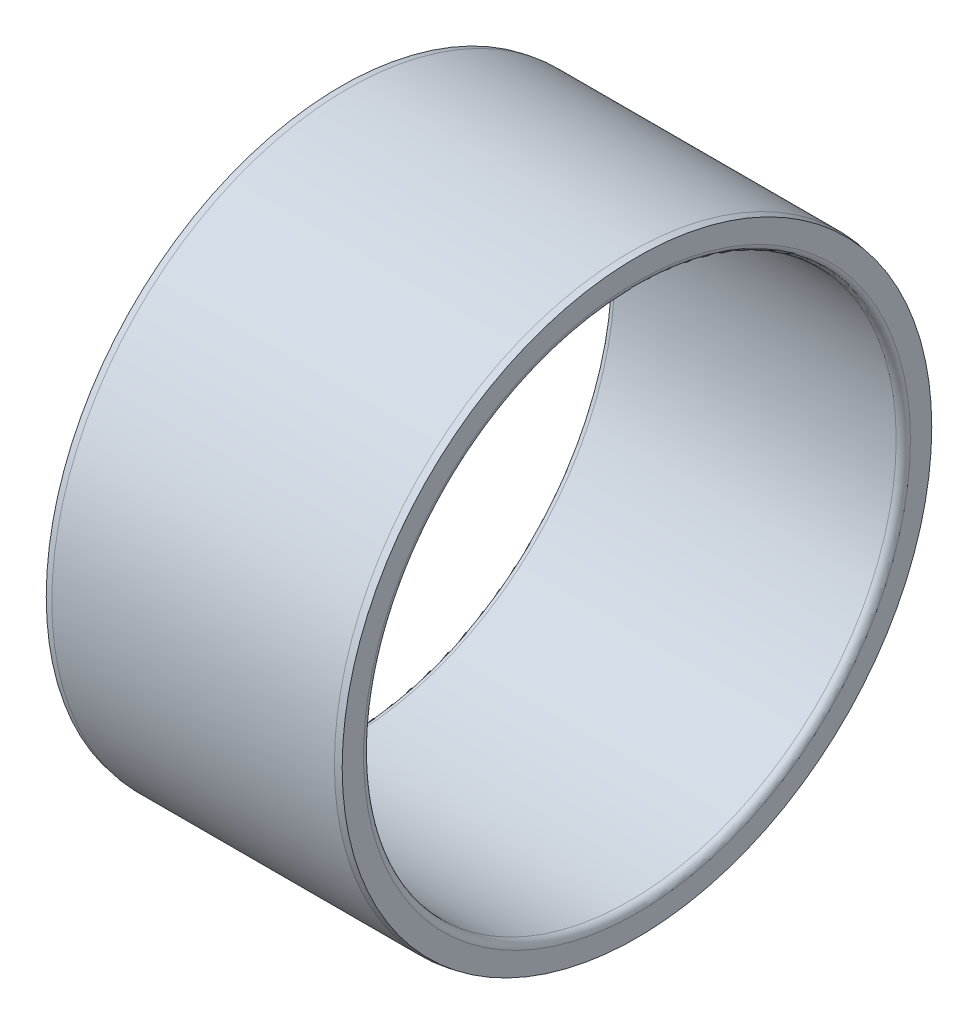
ISO-10303-21;
HEADER;
FILE_DESCRIPTION(('STEP AP214'),'2;1');
FILE_NAME('part.step','',(''),(''),'','','');
FILE_SCHEMA(('AUTOMOTIVE_DESIGN { 1 0 10303 214 1 1 1 1 }'));
ENDSEC;
DATA;
#1=APPLICATION_CONTEXT('core data for automotive mechanical design processes');
#2=APPLICATION_PROTOCOL_DEFINITION('international standard','automotive_design',2000,#1);
#3=PRODUCT_CONTEXT('',#1,'mechanical');
#4=PRODUCT('Part','Part','',(#3));
#5=PRODUCT_RELATED_PRODUCT_CATEGORY('part','',(#4));
#6=PRODUCT_DEFINITION_FORMATION('','',#4);
#7=PRODUCT_DEFINITION_CONTEXT('part definition',#1,'design');
#8=PRODUCT_DEFINITION('design','',#6,#7);
#9=PRODUCT_DEFINITION_SHAPE('','',#8);
#10=(LENGTH_UNIT() NAMED_UNIT(*) SI_UNIT(.MILLI.,.METRE.));
#11=(NAMED_UNIT(*) PLANE_ANGLE_UNIT() SI_UNIT($,.RADIAN.));
#12=(NAMED_UNIT(*) SI_UNIT($,.STERADIAN.) SOLID_ANGLE_UNIT());
#13=UNCERTAINTY_MEASURE_WITH_UNIT(LENGTH_MEASURE(1.E-05),#10,'distance_accuracy_value','');
#14=(GEOMETRIC_REPRESENTATION_CONTEXT(3) GLOBAL_UNCERTAINTY_ASSIGNED_CONTEXT((#13)) GLOBAL_UNIT_ASSIGNED_CONTEXT((#10,
#11,#12)) REPRESENTATION_CONTEXT('',''));
#15=CARTESIAN_POINT('',(0.,0.,0.));
#16=DIRECTION('',(0.,0.,1.));
#17=DIRECTION('',(1.,0.,0.));
#18=AXIS2_PLACEMENT_3D('',#15,#16,#17);
#19=CARTESIAN_POINT('',(0.,24.90437,0.));
#20=DIRECTION('',(-1.,0.,0.));
#21=DIRECTION('',(0.,0.,1.));
#22=AXIS2_PLACEMENT_3D('',#19,#20,#21);
#23=PLANE('',#22);
#24=CARTESIAN_POINT('',(0.,0.,0.));
#25=DIRECTION('',(1.,0.,0.));
#26=DIRECTION('',(0.,0.,-1.));
#27=AXIS2_PLACEMENT_3D('',#24,#25,#26);
#28=CIRCLE('',#27,23.1);
#29=CARTESIAN_POINT('',(0.,0.,-23.1));
#30=VERTEX_POINT('',#29);
#31=EDGE_CURVE('E44',#30,#30,#28,.T.);
#32=ORIENTED_EDGE('',*,*,#31,.T.);
#33=EDGE_LOOP('',(#32));
#34=FACE_BOUND('',#33,.T.);
#35=CARTESIAN_POINT('',(0.,0.,0.));
#36=DIRECTION('',(1.,0.,0.));
#37=DIRECTION('',(0.,0.,-1.));
#38=AXIS2_PLACEMENT_3D('',#35,#36,#37);
#39=CIRCLE('',#38,24.90437);
#40=CARTESIAN_POINT('',(0.,0.,-24.90437));
#41=VERTEX_POINT('',#40);
#42=EDGE_CURVE('E41',#41,#41,#39,.T.);
#43=ORIENTED_EDGE('',*,*,#42,.F.);
#44=EDGE_LOOP('',(#43));
#45=FACE_BOUND('',#44,.T.);
#46=ADVANCED_FACE('F15',(#34,#45),#23,.T.);
#47=CARTESIAN_POINT('',(0.599999999999879,0.,0.));
#48=DIRECTION('',(1.,0.,0.));
#49=DIRECTION('',(0.,0.,-1.));
#50=AXIS2_PLACEMENT_3D('',#47,#48,#49);
#51=TOROIDAL_SURFACE('',#50,23.1,0.599999999999879);
#52=CARTESIAN_POINT('',(0.6,0.,0.));
#53=DIRECTION('',(1.,0.,0.));
#54=DIRECTION('',(0.,0.,-1.));
#55=AXIS2_PLACEMENT_3D('',#52,#53,#54);
#56=CIRCLE('',#55,22.5);
#57=CARTESIAN_POINT('',(0.6,0.,-22.5));
#58=VERTEX_POINT('',#57);
#59=EDGE_CURVE('E38',#58,#58,#56,.T.);
#60=ORIENTED_EDGE('',*,*,#59,.T.);
#61=EDGE_LOOP('',(#60));
#62=FACE_BOUND('',#61,.T.);
#63=ORIENTED_EDGE('',*,*,#31,.F.);
#64=EDGE_LOOP('',(#63));
#65=FACE_BOUND('',#64,.T.);
#66=ADVANCED_FACE('F50',(#62,#65),#51,.T.);
#67=CARTESIAN_POINT('',(0.5625,0.,0.));
#68=DIRECTION('',(1.,0.,0.));
#69=DIRECTION('',(0.,0.,-1.));
#70=AXIS2_PLACEMENT_3D('',#67,#68,#69);
#71=CONICAL_SURFACE('',#70,25.,0.168398796350401);
#72=ORIENTED_EDGE('',*,*,#42,.T.);
#73=EDGE_LOOP('',(#72));
#74=FACE_BOUND('',#73,.T.);
#75=CARTESIAN_POINT('',(0.5625,0.,0.));
#76=DIRECTION('',(1.,0.,0.));
#77=DIRECTION('',(0.,0.,-1.));
#78=AXIS2_PLACEMENT_3D('',#75,#76,#77);
#79=CIRCLE('',#78,25.);
#80=CARTESIAN_POINT('',(0.5625,0.,-25.));
#81=VERTEX_POINT('',#80);
#82=EDGE_CURVE('E35',#81,#81,#79,.T.);
#83=ORIENTED_EDGE('',*,*,#82,.F.);
#84=EDGE_LOOP('',(#83));
#85=FACE_BOUND('',#84,.T.);
#86=ADVANCED_FACE('F52',(#74,#85),#71,.T.);
#87=CARTESIAN_POINT('',(25.,0.,0.));
#88=DIRECTION('',(1.,0.,0.));
#89=DIRECTION('',(0.,0.,-1.));
#90=AXIS2_PLACEMENT_3D('',#87,#88,#89);
#91=CYLINDRICAL_SURFACE('',#90,22.5);
#92=CARTESIAN_POINT('',(24.4,0.,0.));
#93=DIRECTION('',(1.,0.,0.));
#94=DIRECTION('',(0.,0.,-1.));
#95=AXIS2_PLACEMENT_3D('',#92,#93,#94);
#96=CIRCLE('',#95,22.5);
#97=CARTESIAN_POINT('',(24.4,0.,-22.5));
#98=VERTEX_POINT('',#97);
#99=EDGE_CURVE('E30',#98,#98,#96,.T.);
#100=ORIENTED_EDGE('',*,*,#99,.T.);
#101=EDGE_LOOP('',(#100));
#102=FACE_BOUND('',#101,.T.);
#103=ORIENTED_EDGE('',*,*,#59,.F.);
#104=EDGE_LOOP('',(#103));
#105=FACE_BOUND('',#104,.T.);
#106=ADVANCED_FACE('F60',(#102,#105),#91,.F.);
#107=CARTESIAN_POINT('',(25.,0.,0.));
#108=DIRECTION('',(1.,0.,0.));
#109=DIRECTION('',(0.,0.,-1.));
#110=AXIS2_PLACEMENT_3D('',#107,#108,#109);
#111=CYLINDRICAL_SURFACE('',#110,25.);
#112=ORIENTED_EDGE('',*,*,#82,.T.);
#113=EDGE_LOOP('',(#112));
#114=FACE_BOUND('',#113,.T.);
#115=CARTESIAN_POINT('',(24.4375,0.,0.));
#116=DIRECTION('',(1.,0.,0.));
#117=DIRECTION('',(0.,0.,-1.));
#118=AXIS2_PLACEMENT_3D('',#115,#116,#117);
#119=CIRCLE('',#118,25.);
#120=CARTESIAN_POINT('',(24.4375,0.,-25.));
#121=VERTEX_POINT('',#120);
#122=EDGE_CURVE('E26',#121,#121,#119,.T.);
#123=ORIENTED_EDGE('',*,*,#122,.F.);
#124=EDGE_LOOP('',(#123));
#125=FACE_BOUND('',#124,.T.);
#126=ADVANCED_FACE('F67',(#114,#125),#111,.T.);
#127=CARTESIAN_POINT('',(24.4000000000003,0.,0.));
#128=DIRECTION('',(1.,0.,0.));
#129=DIRECTION('',(0.,0.,-1.));
#130=AXIS2_PLACEMENT_3D('',#127,#128,#129);
#131=TOROIDAL_SURFACE('',#130,23.0999999999997,0.59999999999976);
#132=CARTESIAN_POINT('',(25.,0.,0.));
#133=DIRECTION('',(1.,0.,0.));
#134=DIRECTION('',(0.,0.,-1.));
#135=AXIS2_PLACEMENT_3D('',#132,#133,#134);
#136=CIRCLE('',#135,23.1000001141469);
#137=CARTESIAN_POINT('',(25.,0.,-23.1000001141469));
#138=VERTEX_POINT('',#137);
#139=EDGE_CURVE('E22',#138,#138,#136,.T.);
#140=ORIENTED_EDGE('',*,*,#139,.T.);
#141=EDGE_LOOP('',(#140));
#142=FACE_BOUND('',#141,.T.);
#143=ORIENTED_EDGE('',*,*,#99,.F.);
#144=EDGE_LOOP('',(#143));
#145=FACE_BOUND('',#144,.T.);
#146=ADVANCED_FACE('F71',(#142,#145),#131,.T.);
#147=CARTESIAN_POINT('',(25.,0.,0.));
#148=DIRECTION('',(-1.,0.,0.));
#149=DIRECTION('',(0.,0.,1.));
#150=AXIS2_PLACEMENT_3D('',#147,#148,#149);
#151=CONICAL_SURFACE('',#150,24.90437,0.168398796350401);
#152=ORIENTED_EDGE('',*,*,#122,.T.);
#153=EDGE_LOOP('',(#152));
#154=FACE_BOUND('',#153,.T.);
#155=CARTESIAN_POINT('',(25.,0.,0.));
#156=DIRECTION('',(1.,0.,0.));
#157=DIRECTION('',(0.,0.,-1.));
#158=AXIS2_PLACEMENT_3D('',#155,#156,#157);
#159=CIRCLE('',#158,24.90437);
#160=CARTESIAN_POINT('',(25.,0.,-24.90437));
#161=VERTEX_POINT('',#160);
#162=EDGE_CURVE('E10',#161,#161,#159,.T.);
#163=ORIENTED_EDGE('',*,*,#162,.F.);
#164=EDGE_LOOP('',(#163));
#165=FACE_BOUND('',#164,.T.);
#166=ADVANCED_FACE('F74',(#154,#165),#151,.T.);
#167=CARTESIAN_POINT('',(25.,23.1,0.));
#168=DIRECTION('',(1.,0.,0.));
#169=DIRECTION('',(0.,0.,-1.));
#170=AXIS2_PLACEMENT_3D('',#167,#168,#169);
#171=PLANE('',#170);
#172=ORIENTED_EDGE('',*,*,#162,.T.);
#173=EDGE_LOOP('',(#172));
#174=FACE_BOUND('',#173,.T.);
#175=ORIENTED_EDGE('',*,*,#139,.F.);
#176=EDGE_LOOP('',(#175));
#177=FACE_BOUND('',#176,.T.);
#178=ADVANCED_FACE('F17',(#174,#177),#171,.T.);
#179=CLOSED_SHELL('',(#46,#66,#86,#106,#126,#146,#166,#178));
#180=MANIFOLD_SOLID_BREP('B1',#179);
#181=ADVANCED_BREP_SHAPE_REPRESENTATION('',(#18,#180),#14);
#182=SHAPE_DEFINITION_REPRESENTATION(#9,#181);
ENDSEC;
END-ISO-10303-21;
